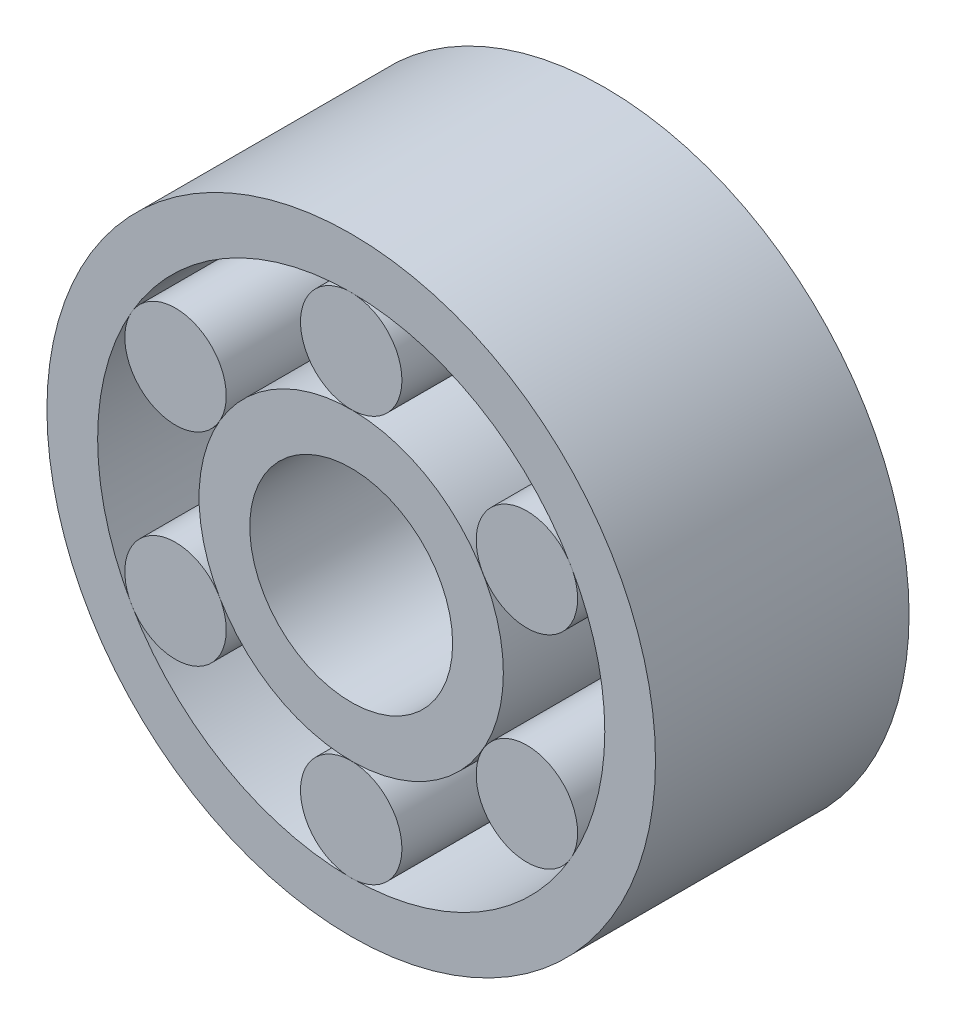
ISO-10303-21;
HEADER;
FILE_DESCRIPTION(('STEP AP214'),'2;1');
FILE_NAME('part.step','',(''),(''),'','','');
FILE_SCHEMA(('AUTOMOTIVE_DESIGN { 1 0 10303 214 1 1 1 1 }'));
ENDSEC;
DATA;
#1=APPLICATION_CONTEXT('core data for automotive mechanical design processes');
#2=APPLICATION_PROTOCOL_DEFINITION('international standard','automotive_design',2000,#1);
#3=PRODUCT_CONTEXT('',#1,'mechanical');
#4=PRODUCT('Part','Part','',(#3));
#5=PRODUCT_RELATED_PRODUCT_CATEGORY('part','',(#4));
#6=PRODUCT_DEFINITION_FORMATION('','',#4);
#7=PRODUCT_DEFINITION_CONTEXT('part definition',#1,'design');
#8=PRODUCT_DEFINITION('design','',#6,#7);
#9=PRODUCT_DEFINITION_SHAPE('','',#8);
#10=(LENGTH_UNIT() NAMED_UNIT(*) SI_UNIT(.MILLI.,.METRE.));
#11=(NAMED_UNIT(*) PLANE_ANGLE_UNIT() SI_UNIT($,.RADIAN.));
#12=(NAMED_UNIT(*) SI_UNIT($,.STERADIAN.) SOLID_ANGLE_UNIT());
#13=UNCERTAINTY_MEASURE_WITH_UNIT(LENGTH_MEASURE(1.E-05),#10,'distance_accuracy_value','');
#14=(GEOMETRIC_REPRESENTATION_CONTEXT(3) GLOBAL_UNCERTAINTY_ASSIGNED_CONTEXT((#13)) GLOBAL_UNIT_ASSIGNED_CONTEXT((#10,
#11,#12)) REPRESENTATION_CONTEXT('',''));
#15=CARTESIAN_POINT('',(0.,0.,0.));
#16=DIRECTION('',(0.,0.,1.));
#17=DIRECTION('',(1.,0.,0.));
#18=AXIS2_PLACEMENT_3D('',#15,#16,#17);
#19=CARTESIAN_POINT('',(-1.73205080756875,-1.00000000000007,2.5));
#20=DIRECTION('',(0.,0.,-1.));
#21=DIRECTION('',(-1.,0.,0.));
#22=AXIS2_PLACEMENT_3D('',#19,#20,#21);
#23=CYLINDRICAL_SURFACE('',#22,0.500000000000162);
#24=CARTESIAN_POINT('',(-1.73205080756875,-1.00000000000007,2.5));
#25=DIRECTION('',(0.,0.,1.));
#26=DIRECTION('',(1.,0.,0.));
#27=AXIS2_PLACEMENT_3D('',#24,#25,#26);
#28=CIRCLE('',#27,0.500000000000162);
#29=CARTESIAN_POINT('',(-1.23205080756859,-1.00000000000007,2.5));
#30=VERTEX_POINT('',#29);
#31=EDGE_CURVE('E12',#30,#30,#28,.T.);
#32=ORIENTED_EDGE('',*,*,#31,.F.);
#33=EDGE_LOOP('',(#32));
#34=FACE_BOUND('',#33,.T.);
#35=CARTESIAN_POINT('',(-1.73205080756875,-1.00000000000007,0.));
#36=DIRECTION('',(0.,0.,1.));
#37=DIRECTION('',(1.,0.,0.));
#38=AXIS2_PLACEMENT_3D('',#35,#36,#37);
#39=CIRCLE('',#38,0.500000000000162);
#40=CARTESIAN_POINT('',(-1.23205080756859,-1.00000000000007,0.));
#41=VERTEX_POINT('',#40);
#42=EDGE_CURVE('E121',#41,#41,#39,.T.);
#43=ORIENTED_EDGE('',*,*,#42,.T.);
#44=EDGE_LOOP('',(#43));
#45=FACE_BOUND('',#44,.T.);
#46=ADVANCED_FACE('F118',(#34,#45),#23,.T.);
#47=CARTESIAN_POINT('',(0.,0.,2.5));
#48=DIRECTION('',(0.,0.,1.));
#49=DIRECTION('',(1.,0.,0.));
#50=AXIS2_PLACEMENT_3D('',#47,#48,#49);
#51=PLANE('',#50);
#52=ORIENTED_EDGE('',*,*,#31,.T.);
#53=EDGE_LOOP('',(#52));
#54=FACE_BOUND('',#53,.T.);
#55=ADVANCED_FACE('F133',(#54),#51,.T.);
#56=CARTESIAN_POINT('',(0.,0.,0.));
#57=DIRECTION('',(0.,0.,1.));
#58=DIRECTION('',(1.,0.,0.));
#59=AXIS2_PLACEMENT_3D('',#56,#57,#58);
#60=PLANE('',#59);
#61=ORIENTED_EDGE('',*,*,#42,.F.);
#62=EDGE_LOOP('',(#61));
#63=FACE_BOUND('',#62,.T.);
#64=ADVANCED_FACE('F131',(#63),#60,.F.);
#65=CLOSED_SHELL('',(#46,#55,#64));
#66=MANIFOLD_SOLID_BREP('B2',#65);
#67=CARTESIAN_POINT('',(1.69795468502936E-13,-2.,2.5));
#68=DIRECTION('',(0.,0.,-1.));
#69=DIRECTION('',(-1.,0.,0.));
#70=AXIS2_PLACEMENT_3D('',#67,#68,#69);
#71=CYLINDRICAL_SURFACE('',#70,0.500000000000176);
#72=CARTESIAN_POINT('',(1.69795468502936E-13,-2.,2.5));
#73=DIRECTION('',(0.,0.,1.));
#74=DIRECTION('',(1.,0.,0.));
#75=AXIS2_PLACEMENT_3D('',#72,#73,#74);
#76=CIRCLE('',#75,0.500000000000176);
#77=CARTESIAN_POINT('',(0.500000000000345,-2.,2.5));
#78=VERTEX_POINT('',#77);
#79=EDGE_CURVE('E117',#78,#78,#76,.T.);
#80=ORIENTED_EDGE('',*,*,#79,.F.);
#81=EDGE_LOOP('',(#80));
#82=FACE_BOUND('',#81,.T.);
#83=CARTESIAN_POINT('',(1.69795468502936E-13,-2.,0.));
#84=DIRECTION('',(0.,0.,1.));
#85=DIRECTION('',(1.,0.,0.));
#86=AXIS2_PLACEMENT_3D('',#83,#84,#85);
#87=CIRCLE('',#86,0.500000000000176);
#88=CARTESIAN_POINT('',(0.500000000000345,-2.,0.));
#89=VERTEX_POINT('',#88);
#90=EDGE_CURVE('E170',#89,#89,#87,.T.);
#91=ORIENTED_EDGE('',*,*,#90,.T.);
#92=EDGE_LOOP('',(#91));
#93=FACE_BOUND('',#92,.T.);
#94=ADVANCED_FACE('F167',(#82,#93),#71,.T.);
#95=CARTESIAN_POINT('',(0.,0.,2.5));
#96=DIRECTION('',(0.,0.,1.));
#97=DIRECTION('',(1.,0.,0.));
#98=AXIS2_PLACEMENT_3D('',#95,#96,#97);
#99=PLANE('',#98);
#100=ORIENTED_EDGE('',*,*,#79,.T.);
#101=EDGE_LOOP('',(#100));
#102=FACE_BOUND('',#101,.T.);
#103=ADVANCED_FACE('F182',(#102),#99,.T.);
#104=CARTESIAN_POINT('',(0.,0.,0.));
#105=DIRECTION('',(0.,0.,1.));
#106=DIRECTION('',(1.,0.,0.));
#107=AXIS2_PLACEMENT_3D('',#104,#105,#106);
#108=PLANE('',#107);
#109=ORIENTED_EDGE('',*,*,#90,.F.);
#110=EDGE_LOOP('',(#109));
#111=FACE_BOUND('',#110,.T.);
#112=ADVANCED_FACE('F180',(#111),#108,.F.);
#113=CLOSED_SHELL('',(#94,#103,#112));
#114=MANIFOLD_SOLID_BREP('B7',#113);
#115=CARTESIAN_POINT('',(1.732050807569,-0.999999999999926,2.5));
#116=DIRECTION('',(0.,0.,-1.));
#117=DIRECTION('',(-1.,0.,0.));
#118=AXIS2_PLACEMENT_3D('',#115,#116,#117);
#119=CYLINDRICAL_SURFACE('',#118,0.50000000000011);
#120=CARTESIAN_POINT('',(1.732050807569,-0.999999999999926,2.5));
#121=DIRECTION('',(0.,0.,1.));
#122=DIRECTION('',(1.,0.,0.));
#123=AXIS2_PLACEMENT_3D('',#120,#121,#122);
#124=CIRCLE('',#123,0.50000000000011);
#125=CARTESIAN_POINT('',(2.23205080756911,-0.999999999999926,2.5));
#126=VERTEX_POINT('',#125);
#127=EDGE_CURVE('E166',#126,#126,#124,.T.);
#128=ORIENTED_EDGE('',*,*,#127,.F.);
#129=EDGE_LOOP('',(#128));
#130=FACE_BOUND('',#129,.T.);
#131=CARTESIAN_POINT('',(1.732050807569,-0.999999999999926,0.));
#132=DIRECTION('',(0.,0.,1.));
#133=DIRECTION('',(1.,0.,0.));
#134=AXIS2_PLACEMENT_3D('',#131,#132,#133);
#135=CIRCLE('',#134,0.50000000000011);
#136=CARTESIAN_POINT('',(2.23205080756911,-0.999999999999926,0.));
#137=VERTEX_POINT('',#136);
#138=EDGE_CURVE('E219',#137,#137,#135,.T.);
#139=ORIENTED_EDGE('',*,*,#138,.T.);
#140=EDGE_LOOP('',(#139));
#141=FACE_BOUND('',#140,.T.);
#142=ADVANCED_FACE('F216',(#130,#141),#119,.T.);
#143=CARTESIAN_POINT('',(0.,0.,2.5));
#144=DIRECTION('',(0.,0.,1.));
#145=DIRECTION('',(1.,0.,0.));
#146=AXIS2_PLACEMENT_3D('',#143,#144,#145);
#147=PLANE('',#146);
#148=ORIENTED_EDGE('',*,*,#127,.T.);
#149=EDGE_LOOP('',(#148));
#150=FACE_BOUND('',#149,.T.);
#151=ADVANCED_FACE('F231',(#150),#147,.T.);
#152=CARTESIAN_POINT('',(0.,0.,0.));
#153=DIRECTION('',(0.,0.,1.));
#154=DIRECTION('',(1.,0.,0.));
#155=AXIS2_PLACEMENT_3D('',#152,#153,#154);
#156=PLANE('',#155);
#157=ORIENTED_EDGE('',*,*,#138,.F.);
#158=EDGE_LOOP('',(#157));
#159=FACE_BOUND('',#158,.T.);
#160=ADVANCED_FACE('F229',(#159),#156,.F.);
#161=CLOSED_SHELL('',(#142,#151,#160));
#162=MANIFOLD_SOLID_BREP('B112',#161);
#163=CARTESIAN_POINT('',(1.73205080756892,1.00000000000007,2.5));
#164=DIRECTION('',(0.,0.,-1.));
#165=DIRECTION('',(-1.,0.,0.));
#166=AXIS2_PLACEMENT_3D('',#163,#164,#165);
#167=CYLINDRICAL_SURFACE('',#166,0.500000000000024);
#168=CARTESIAN_POINT('',(1.73205080756892,1.00000000000007,2.5));
#169=DIRECTION('',(0.,0.,1.));
#170=DIRECTION('',(1.,0.,0.));
#171=AXIS2_PLACEMENT_3D('',#168,#169,#170);
#172=CIRCLE('',#171,0.500000000000024);
#173=CARTESIAN_POINT('',(2.23205080756894,1.00000000000007,2.5));
#174=VERTEX_POINT('',#173);
#175=EDGE_CURVE('E215',#174,#174,#172,.T.);
#176=ORIENTED_EDGE('',*,*,#175,.F.);
#177=EDGE_LOOP('',(#176));
#178=FACE_BOUND('',#177,.T.);
#179=CARTESIAN_POINT('',(1.73205080756892,1.00000000000007,0.));
#180=DIRECTION('',(0.,0.,1.));
#181=DIRECTION('',(1.,0.,0.));
#182=AXIS2_PLACEMENT_3D('',#179,#180,#181);
#183=CIRCLE('',#182,0.500000000000024);
#184=CARTESIAN_POINT('',(2.23205080756894,1.00000000000007,0.));
#185=VERTEX_POINT('',#184);
#186=EDGE_CURVE('E268',#185,#185,#183,.T.);
#187=ORIENTED_EDGE('',*,*,#186,.T.);
#188=EDGE_LOOP('',(#187));
#189=FACE_BOUND('',#188,.T.);
#190=ADVANCED_FACE('F265',(#178,#189),#167,.T.);
#191=CARTESIAN_POINT('',(0.,0.,2.5));
#192=DIRECTION('',(0.,0.,1.));
#193=DIRECTION('',(1.,0.,0.));
#194=AXIS2_PLACEMENT_3D('',#191,#192,#193);
#195=PLANE('',#194);
#196=ORIENTED_EDGE('',*,*,#175,.T.);
#197=EDGE_LOOP('',(#196));
#198=FACE_BOUND('',#197,.T.);
#199=ADVANCED_FACE('F280',(#198),#195,.T.);
#200=CARTESIAN_POINT('',(0.,0.,0.));
#201=DIRECTION('',(0.,0.,1.));
#202=DIRECTION('',(1.,0.,0.));
#203=AXIS2_PLACEMENT_3D('',#200,#201,#202);
#204=PLANE('',#203);
#205=ORIENTED_EDGE('',*,*,#186,.F.);
#206=EDGE_LOOP('',(#205));
#207=FACE_BOUND('',#206,.T.);
#208=ADVANCED_FACE('F278',(#207),#204,.F.);
#209=CLOSED_SHELL('',(#190,#199,#208));
#210=MANIFOLD_SOLID_BREP('B161',#209);
#211=CARTESIAN_POINT('',(-1.73205080756884,0.999999999999925,2.5));
#212=DIRECTION('',(0.,0.,-1.));
#213=DIRECTION('',(-1.,0.,0.));
#214=AXIS2_PLACEMENT_3D('',#211,#212,#213);
#215=CYLINDRICAL_SURFACE('',#214,0.500000000000086);
#216=CARTESIAN_POINT('',(-1.73205080756884,0.999999999999925,2.5));
#217=DIRECTION('',(0.,0.,1.));
#218=DIRECTION('',(1.,0.,0.));
#219=AXIS2_PLACEMENT_3D('',#216,#217,#218);
#220=CIRCLE('',#219,0.500000000000086);
#221=CARTESIAN_POINT('',(-1.23205080756875,0.999999999999925,2.5));
#222=VERTEX_POINT('',#221);
#223=EDGE_CURVE('E264',#222,#222,#220,.T.);
#224=ORIENTED_EDGE('',*,*,#223,.F.);
#225=EDGE_LOOP('',(#224));
#226=FACE_BOUND('',#225,.T.);
#227=CARTESIAN_POINT('',(-1.73205080756884,0.999999999999925,0.));
#228=DIRECTION('',(0.,0.,1.));
#229=DIRECTION('',(1.,0.,0.));
#230=AXIS2_PLACEMENT_3D('',#227,#228,#229);
#231=CIRCLE('',#230,0.500000000000086);
#232=CARTESIAN_POINT('',(-1.23205080756875,0.999999999999925,0.));
#233=VERTEX_POINT('',#232);
#234=EDGE_CURVE('E317',#233,#233,#231,.T.);
#235=ORIENTED_EDGE('',*,*,#234,.T.);
#236=EDGE_LOOP('',(#235));
#237=FACE_BOUND('',#236,.T.);
#238=ADVANCED_FACE('F314',(#226,#237),#215,.T.);
#239=CARTESIAN_POINT('',(0.,0.,2.5));
#240=DIRECTION('',(0.,0.,1.));
#241=DIRECTION('',(1.,0.,0.));
#242=AXIS2_PLACEMENT_3D('',#239,#240,#241);
#243=PLANE('',#242);
#244=ORIENTED_EDGE('',*,*,#223,.T.);
#245=EDGE_LOOP('',(#244));
#246=FACE_BOUND('',#245,.T.);
#247=ADVANCED_FACE('F329',(#246),#243,.T.);
#248=CARTESIAN_POINT('',(0.,0.,0.));
#249=DIRECTION('',(0.,0.,1.));
#250=DIRECTION('',(1.,0.,0.));
#251=AXIS2_PLACEMENT_3D('',#248,#249,#250);
#252=PLANE('',#251);
#253=ORIENTED_EDGE('',*,*,#234,.F.);
#254=EDGE_LOOP('',(#253));
#255=FACE_BOUND('',#254,.T.);
#256=ADVANCED_FACE('F327',(#255),#252,.F.);
#257=CLOSED_SHELL('',(#238,#247,#256));
#258=MANIFOLD_SOLID_BREP('B210',#257);
#259=CARTESIAN_POINT('',(0.,0.,2.5));
#260=DIRECTION('',(0.,0.,-1.));
#261=DIRECTION('',(-1.,0.,0.));
#262=AXIS2_PLACEMENT_3D('',#259,#260,#261);
#263=CYLINDRICAL_SURFACE('',#262,2.5);
#264=CARTESIAN_POINT('',(0.,0.,2.5));
#265=DIRECTION('',(0.,0.,1.));
#266=DIRECTION('',(1.,0.,0.));
#267=AXIS2_PLACEMENT_3D('',#264,#265,#266);
#268=CIRCLE('',#267,2.5);
#269=CARTESIAN_POINT('',(2.5,0.,2.5));
#270=VERTEX_POINT('',#269);
#271=EDGE_CURVE('E370',#270,#270,#268,.T.);
#272=ORIENTED_EDGE('',*,*,#271,.T.);
#273=EDGE_LOOP('',(#272));
#274=FACE_BOUND('',#273,.T.);
#275=CARTESIAN_POINT('',(0.,0.,0.));
#276=DIRECTION('',(0.,0.,1.));
#277=DIRECTION('',(1.,0.,0.));
#278=AXIS2_PLACEMENT_3D('',#275,#276,#277);
#279=CIRCLE('',#278,2.5);
#280=CARTESIAN_POINT('',(2.5,0.,0.));
#281=VERTEX_POINT('',#280);
#282=EDGE_CURVE('E376',#281,#281,#279,.T.);
#283=ORIENTED_EDGE('',*,*,#282,.F.);
#284=EDGE_LOOP('',(#283));
#285=FACE_BOUND('',#284,.T.);
#286=ADVANCED_FACE('F363',(#274,#285),#263,.F.);
#287=CARTESIAN_POINT('',(0.,0.,2.5));
#288=DIRECTION('',(0.,0.,-1.));
#289=DIRECTION('',(-1.,0.,0.));
#290=AXIS2_PLACEMENT_3D('',#287,#288,#289);
#291=CYLINDRICAL_SURFACE('',#290,3.);
#292=CARTESIAN_POINT('',(0.,0.,2.5));
#293=DIRECTION('',(0.,0.,1.));
#294=DIRECTION('',(1.,0.,0.));
#295=AXIS2_PLACEMENT_3D('',#292,#293,#294);
#296=CIRCLE('',#295,3.);
#297=CARTESIAN_POINT('',(3.,0.,2.5));
#298=VERTEX_POINT('',#297);
#299=EDGE_CURVE('E313',#298,#298,#296,.T.);
#300=ORIENTED_EDGE('',*,*,#299,.F.);
#301=EDGE_LOOP('',(#300));
#302=FACE_BOUND('',#301,.T.);
#303=CARTESIAN_POINT('',(0.,0.,0.));
#304=DIRECTION('',(0.,0.,1.));
#305=DIRECTION('',(1.,0.,0.));
#306=AXIS2_PLACEMENT_3D('',#303,#304,#305);
#307=CIRCLE('',#306,3.);
#308=CARTESIAN_POINT('',(3.,0.,0.));
#309=VERTEX_POINT('',#308);
#310=EDGE_CURVE('E366',#309,#309,#307,.T.);
#311=ORIENTED_EDGE('',*,*,#310,.T.);
#312=EDGE_LOOP('',(#311));
#313=FACE_BOUND('',#312,.T.);
#314=ADVANCED_FACE('F383',(#302,#313),#291,.T.);
#315=CARTESIAN_POINT('',(0.,0.,2.5));
#316=DIRECTION('',(0.,0.,1.));
#317=DIRECTION('',(1.,0.,0.));
#318=AXIS2_PLACEMENT_3D('',#315,#316,#317);
#319=PLANE('',#318);
#320=ORIENTED_EDGE('',*,*,#271,.F.);
#321=EDGE_LOOP('',(#320));
#322=FACE_BOUND('',#321,.T.);
#323=ORIENTED_EDGE('',*,*,#299,.T.);
#324=EDGE_LOOP('',(#323));
#325=FACE_BOUND('',#324,.T.);
#326=ADVANCED_FACE('F387',(#322,#325),#319,.T.);
#327=CARTESIAN_POINT('',(0.,0.,0.));
#328=DIRECTION('',(0.,0.,1.));
#329=DIRECTION('',(1.,0.,0.));
#330=AXIS2_PLACEMENT_3D('',#327,#328,#329);
#331=PLANE('',#330);
#332=ORIENTED_EDGE('',*,*,#282,.T.);
#333=EDGE_LOOP('',(#332));
#334=FACE_BOUND('',#333,.T.);
#335=ORIENTED_EDGE('',*,*,#310,.F.);
#336=EDGE_LOOP('',(#335));
#337=FACE_BOUND('',#336,.T.);
#338=ADVANCED_FACE('F385',(#334,#337),#331,.F.);
#339=CLOSED_SHELL('',(#286,#314,#326,#338));
#340=MANIFOLD_SOLID_BREP('B259',#339);
#341=CARTESIAN_POINT('',(0.,2.,2.5));
#342=DIRECTION('',(0.,0.,-1.));
#343=DIRECTION('',(-1.,0.,0.));
#344=AXIS2_PLACEMENT_3D('',#341,#342,#343);
#345=CYLINDRICAL_SURFACE('',#344,0.5);
#346=CARTESIAN_POINT('',(0.,2.,2.5));
#347=DIRECTION('',(0.,0.,1.));
#348=DIRECTION('',(1.,0.,0.));
#349=AXIS2_PLACEMENT_3D('',#346,#347,#348);
#350=CIRCLE('',#349,0.5);
#351=CARTESIAN_POINT('',(0.5,2.,2.5));
#352=VERTEX_POINT('',#351);
#353=EDGE_CURVE('E362',#352,#352,#350,.T.);
#354=ORIENTED_EDGE('',*,*,#353,.F.);
#355=EDGE_LOOP('',(#354));
#356=FACE_BOUND('',#355,.T.);
#357=CARTESIAN_POINT('',(0.,2.,0.));
#358=DIRECTION('',(0.,0.,1.));
#359=DIRECTION('',(1.,0.,0.));
#360=AXIS2_PLACEMENT_3D('',#357,#358,#359);
#361=CIRCLE('',#360,0.5);
#362=CARTESIAN_POINT('',(0.5,2.,0.));
#363=VERTEX_POINT('',#362);
#364=EDGE_CURVE('E435',#363,#363,#361,.T.);
#365=ORIENTED_EDGE('',*,*,#364,.T.);
#366=EDGE_LOOP('',(#365));
#367=FACE_BOUND('',#366,.T.);
#368=ADVANCED_FACE('F432',(#356,#367),#345,.T.);
#369=CARTESIAN_POINT('',(0.,0.,2.5));
#370=DIRECTION('',(0.,0.,1.));
#371=DIRECTION('',(1.,0.,0.));
#372=AXIS2_PLACEMENT_3D('',#369,#370,#371);
#373=PLANE('',#372);
#374=ORIENTED_EDGE('',*,*,#353,.T.);
#375=EDGE_LOOP('',(#374));
#376=FACE_BOUND('',#375,.T.);
#377=ADVANCED_FACE('F447',(#376),#373,.T.);
#378=CARTESIAN_POINT('',(0.,0.,0.));
#379=DIRECTION('',(0.,0.,1.));
#380=DIRECTION('',(1.,0.,0.));
#381=AXIS2_PLACEMENT_3D('',#378,#379,#380);
#382=PLANE('',#381);
#383=ORIENTED_EDGE('',*,*,#364,.F.);
#384=EDGE_LOOP('',(#383));
#385=FACE_BOUND('',#384,.T.);
#386=ADVANCED_FACE('F445',(#385),#382,.F.);
#387=CLOSED_SHELL('',(#368,#377,#386));
#388=MANIFOLD_SOLID_BREP('B308',#387);
#389=CARTESIAN_POINT('',(0.,0.,2.5));
#390=DIRECTION('',(0.,0.,-1.));
#391=DIRECTION('',(-1.,0.,0.));
#392=AXIS2_PLACEMENT_3D('',#389,#390,#391);
#393=CYLINDRICAL_SURFACE('',#392,1.);
#394=CARTESIAN_POINT('',(0.,0.,2.5));
#395=DIRECTION('',(0.,0.,1.));
#396=DIRECTION('',(1.,0.,0.));
#397=AXIS2_PLACEMENT_3D('',#394,#395,#396);
#398=CIRCLE('',#397,1.);
#399=CARTESIAN_POINT('',(1.,0.,2.5));
#400=VERTEX_POINT('',#399);
#401=EDGE_CURVE('E480',#400,#400,#398,.T.);
#402=ORIENTED_EDGE('',*,*,#401,.T.);
#403=EDGE_LOOP('',(#402));
#404=FACE_BOUND('',#403,.T.);
#405=CARTESIAN_POINT('',(0.,0.,0.));
#406=DIRECTION('',(0.,0.,1.));
#407=DIRECTION('',(1.,0.,0.));
#408=AXIS2_PLACEMENT_3D('',#405,#406,#407);
#409=CIRCLE('',#408,1.);
#410=CARTESIAN_POINT('',(1.,0.,0.));
#411=VERTEX_POINT('',#410);
#412=EDGE_CURVE('E486',#411,#411,#409,.T.);
#413=ORIENTED_EDGE('',*,*,#412,.F.);
#414=EDGE_LOOP('',(#413));
#415=FACE_BOUND('',#414,.T.);
#416=ADVANCED_FACE('F473',(#404,#415),#393,.F.);
#417=CARTESIAN_POINT('',(0.,0.,2.5));
#418=DIRECTION('',(0.,0.,-1.));
#419=DIRECTION('',(-1.,0.,0.));
#420=AXIS2_PLACEMENT_3D('',#417,#418,#419);
#421=CYLINDRICAL_SURFACE('',#420,1.5);
#422=CARTESIAN_POINT('',(0.,0.,2.5));
#423=DIRECTION('',(0.,0.,1.));
#424=DIRECTION('',(1.,0.,0.));
#425=AXIS2_PLACEMENT_3D('',#422,#423,#424);
#426=CIRCLE('',#425,1.5);
#427=CARTESIAN_POINT('',(1.5,0.,2.5));
#428=VERTEX_POINT('',#427);
#429=EDGE_CURVE('E431',#428,#428,#426,.T.);
#430=ORIENTED_EDGE('',*,*,#429,.F.);
#431=EDGE_LOOP('',(#430));
#432=FACE_BOUND('',#431,.T.);
#433=CARTESIAN_POINT('',(0.,0.,0.));
#434=DIRECTION('',(0.,0.,1.));
#435=DIRECTION('',(1.,0.,0.));
#436=AXIS2_PLACEMENT_3D('',#433,#434,#435);
#437=CIRCLE('',#436,1.5);
#438=CARTESIAN_POINT('',(1.5,0.,0.));
#439=VERTEX_POINT('',#438);
#440=EDGE_CURVE('E476',#439,#439,#437,.T.);
#441=ORIENTED_EDGE('',*,*,#440,.T.);
#442=EDGE_LOOP('',(#441));
#443=FACE_BOUND('',#442,.T.);
#444=ADVANCED_FACE('F493',(#432,#443),#421,.T.);
#445=CARTESIAN_POINT('',(0.,0.,2.5));
#446=DIRECTION('',(0.,0.,1.));
#447=DIRECTION('',(1.,0.,0.));
#448=AXIS2_PLACEMENT_3D('',#445,#446,#447);
#449=PLANE('',#448);
#450=ORIENTED_EDGE('',*,*,#401,.F.);
#451=EDGE_LOOP('',(#450));
#452=FACE_BOUND('',#451,.T.);
#453=ORIENTED_EDGE('',*,*,#429,.T.);
#454=EDGE_LOOP('',(#453));
#455=FACE_BOUND('',#454,.T.);
#456=ADVANCED_FACE('F497',(#452,#455),#449,.T.);
#457=CARTESIAN_POINT('',(0.,0.,0.));
#458=DIRECTION('',(0.,0.,1.));
#459=DIRECTION('',(1.,0.,0.));
#460=AXIS2_PLACEMENT_3D('',#457,#458,#459);
#461=PLANE('',#460);
#462=ORIENTED_EDGE('',*,*,#412,.T.);
#463=EDGE_LOOP('',(#462));
#464=FACE_BOUND('',#463,.T.);
#465=ORIENTED_EDGE('',*,*,#440,.F.);
#466=EDGE_LOOP('',(#465));
#467=FACE_BOUND('',#466,.T.);
#468=ADVANCED_FACE('F495',(#464,#467),#461,.F.);
#469=CLOSED_SHELL('',(#416,#444,#456,#468));
#470=MANIFOLD_SOLID_BREP('B357',#469);
#471=ADVANCED_BREP_SHAPE_REPRESENTATION('',(#18,#66,#114,#162,#210,#258,#340,#388,#470),#14);
#472=SHAPE_DEFINITION_REPRESENTATION(#9,#471);
ENDSEC;
END-ISO-10303-21;
